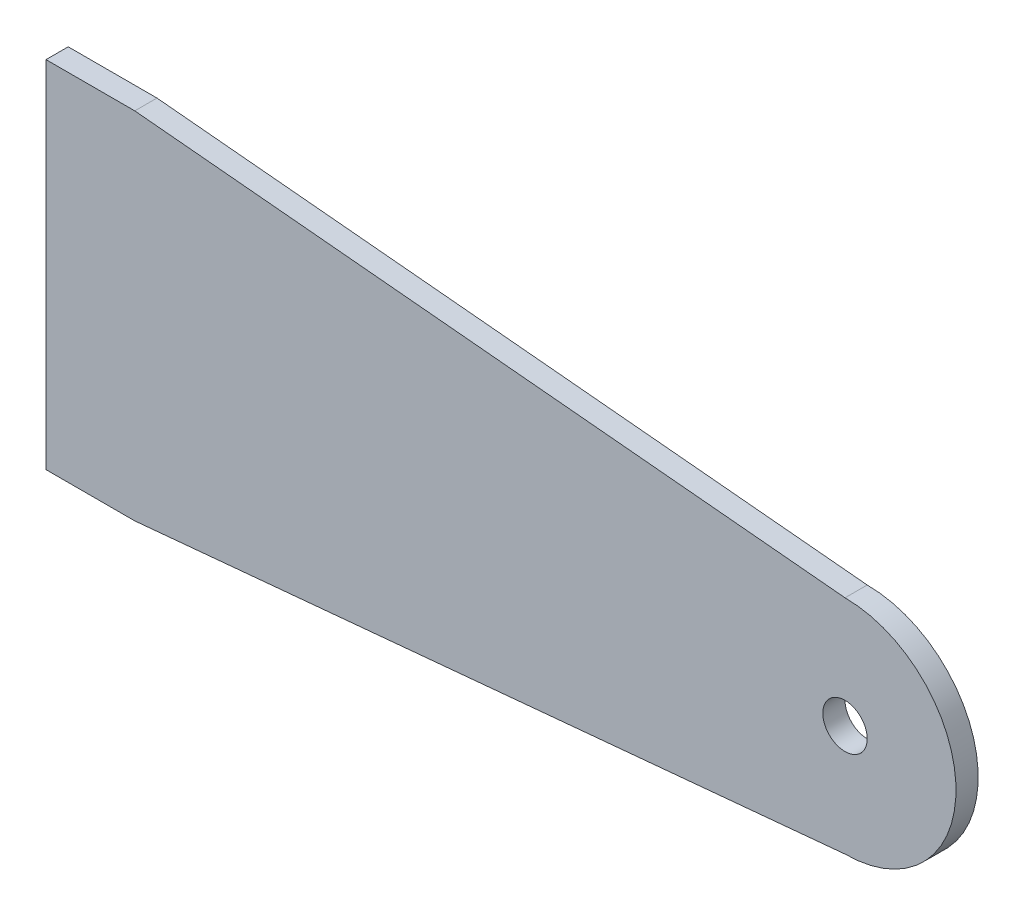
ISO-10303-21;
HEADER;
FILE_DESCRIPTION(('STEP AP214'),'2;1');
FILE_NAME('part.step','',(''),(''),'','','');
FILE_SCHEMA(('AUTOMOTIVE_DESIGN { 1 0 10303 214 1 1 1 1 }'));
ENDSEC;
DATA;
#1=APPLICATION_CONTEXT('core data for automotive mechanical design processes');
#2=APPLICATION_PROTOCOL_DEFINITION('international standard','automotive_design',2000,#1);
#3=PRODUCT_CONTEXT('',#1,'mechanical');
#4=PRODUCT('Part','Part','',(#3));
#5=PRODUCT_RELATED_PRODUCT_CATEGORY('part','',(#4));
#6=PRODUCT_DEFINITION_FORMATION('','',#4);
#7=PRODUCT_DEFINITION_CONTEXT('part definition',#1,'design');
#8=PRODUCT_DEFINITION('design','',#6,#7);
#9=PRODUCT_DEFINITION_SHAPE('','',#8);
#10=(LENGTH_UNIT() NAMED_UNIT(*) SI_UNIT(.MILLI.,.METRE.));
#11=(NAMED_UNIT(*) PLANE_ANGLE_UNIT() SI_UNIT($,.RADIAN.));
#12=(NAMED_UNIT(*) SI_UNIT($,.STERADIAN.) SOLID_ANGLE_UNIT());
#13=UNCERTAINTY_MEASURE_WITH_UNIT(LENGTH_MEASURE(1.E-05),#10,'distance_accuracy_value','');
#14=(GEOMETRIC_REPRESENTATION_CONTEXT(3) GLOBAL_UNCERTAINTY_ASSIGNED_CONTEXT((#13)) GLOBAL_UNIT_ASSIGNED_CONTEXT((#10,
#11,#12)) REPRESENTATION_CONTEXT('',''));
#15=CARTESIAN_POINT('',(0.,0.,0.));
#16=DIRECTION('',(0.,0.,1.));
#17=DIRECTION('',(1.,0.,0.));
#18=AXIS2_PLACEMENT_3D('',#15,#16,#17);
#19=CARTESIAN_POINT('',(101.6,0.,53.975));
#20=DIRECTION('',(0.,0.,1.));
#21=DIRECTION('',(1.,0.,0.));
#22=AXIS2_PLACEMENT_3D('',#19,#20,#21);
#23=PLANE('',#22);
#24=DIRECTION('',(0.,-1.,0.));
#25=VECTOR('',#24,1.);
#26=CARTESIAN_POINT('',(-12.7,25.4,53.975));
#27=LINE('',#26,#25);
#28=CARTESIAN_POINT('',(-12.7,25.4,53.975));
#29=VERTEX_POINT('',#28);
#30=CARTESIAN_POINT('',(-12.7,-25.4,53.975));
#31=VERTEX_POINT('',#30);
#32=EDGE_CURVE('E148',#29,#31,#27,.T.);
#33=ORIENTED_EDGE('',*,*,#32,.T.);
#34=DIRECTION('',(1.,0.,0.));
#35=VECTOR('',#34,1.);
#36=CARTESIAN_POINT('',(-12.7,-25.4,53.975));
#37=LINE('',#36,#35);
#38=CARTESIAN_POINT('',(0.,-25.4,53.975));
#39=VERTEX_POINT('',#38);
#40=EDGE_CURVE('E96',#31,#39,#37,.T.);
#41=ORIENTED_EDGE('',*,*,#40,.T.);
#42=DIRECTION('',(0.995634226059288,0.0933407086930583,0.));
#43=VECTOR('',#42,1.);
#44=CARTESIAN_POINT('',(101.6,-15.875,53.975));
#45=LINE('',#44,#43);
#46=CARTESIAN_POINT('',(101.6,-15.875,53.975));
#47=VERTEX_POINT('',#46);
#48=EDGE_CURVE('E109',#39,#47,#45,.T.);
#49=ORIENTED_EDGE('',*,*,#48,.T.);
#50=CARTESIAN_POINT('',(101.6,0.,53.975));
#51=DIRECTION('',(0.,0.,1.));
#52=DIRECTION('',(1.,0.,0.));
#53=AXIS2_PLACEMENT_3D('',#50,#51,#52);
#54=CIRCLE('',#53,15.875);
#55=CARTESIAN_POINT('',(101.6,15.875,53.975));
#56=VERTEX_POINT('',#55);
#57=EDGE_CURVE('E103',#47,#56,#54,.T.);
#58=ORIENTED_EDGE('',*,*,#57,.T.);
#59=DIRECTION('',(-0.995634226059288,0.0933407086930583,0.));
#60=VECTOR('',#59,1.);
#61=CARTESIAN_POINT('',(101.6,15.875,53.975));
#62=LINE('',#61,#60);
#63=CARTESIAN_POINT('',(0.,25.4,53.975));
#64=VERTEX_POINT('',#63);
#65=EDGE_CURVE('E107',#56,#64,#62,.T.);
#66=ORIENTED_EDGE('',*,*,#65,.T.);
#67=DIRECTION('',(-1.,0.,0.));
#68=VECTOR('',#67,1.);
#69=CARTESIAN_POINT('',(0.,25.4,53.975));
#70=LINE('',#69,#68);
#71=EDGE_CURVE('E59',#64,#29,#70,.T.);
#72=ORIENTED_EDGE('',*,*,#71,.T.);
#73=EDGE_LOOP('',(#33,#41,#49,#58,#66,#72));
#74=FACE_BOUND('',#73,.T.);
#75=CARTESIAN_POINT('',(101.6,0.,53.975));
#76=DIRECTION('',(0.,0.,1.));
#77=DIRECTION('',(1.,0.,0.));
#78=AXIS2_PLACEMENT_3D('',#75,#76,#77);
#79=CIRCLE('',#78,3.175);
#80=CARTESIAN_POINT('',(104.775,0.,53.975));
#81=VERTEX_POINT('',#80);
#82=EDGE_CURVE('E136',#81,#81,#79,.T.);
#83=ORIENTED_EDGE('',*,*,#82,.F.);
#84=EDGE_LOOP('',(#83));
#85=FACE_BOUND('',#84,.T.);
#86=ADVANCED_FACE('F41',(#74,#85),#23,.T.);
#87=CARTESIAN_POINT('',(101.6,0.,50.8));
#88=DIRECTION('',(0.,0.,1.));
#89=DIRECTION('',(1.,0.,0.));
#90=AXIS2_PLACEMENT_3D('',#87,#88,#89);
#91=PLANE('',#90);
#92=DIRECTION('',(0.,-1.,0.));
#93=VECTOR('',#92,1.);
#94=CARTESIAN_POINT('',(-12.7,25.4,50.8));
#95=LINE('',#94,#93);
#96=CARTESIAN_POINT('',(-12.7,25.4,50.8));
#97=VERTEX_POINT('',#96);
#98=CARTESIAN_POINT('',(-12.7,-25.4,50.8));
#99=VERTEX_POINT('',#98);
#100=EDGE_CURVE('E131',#97,#99,#95,.T.);
#101=ORIENTED_EDGE('',*,*,#100,.F.);
#102=DIRECTION('',(-1.,0.,0.));
#103=VECTOR('',#102,1.);
#104=CARTESIAN_POINT('',(0.,25.4,50.8));
#105=LINE('',#104,#103);
#106=CARTESIAN_POINT('',(0.,25.4,50.8));
#107=VERTEX_POINT('',#106);
#108=EDGE_CURVE('E88',#107,#97,#105,.T.);
#109=ORIENTED_EDGE('',*,*,#108,.F.);
#110=DIRECTION('',(-0.995634226059288,0.0933407086930583,0.));
#111=VECTOR('',#110,1.);
#112=CARTESIAN_POINT('',(101.6,15.875,50.8));
#113=LINE('',#112,#111);
#114=CARTESIAN_POINT('',(101.6,15.875,50.8));
#115=VERTEX_POINT('',#114);
#116=EDGE_CURVE('E82',#115,#107,#113,.T.);
#117=ORIENTED_EDGE('',*,*,#116,.F.);
#118=CARTESIAN_POINT('',(101.6,0.,50.8));
#119=DIRECTION('',(0.,0.,1.));
#120=DIRECTION('',(1.,0.,0.));
#121=AXIS2_PLACEMENT_3D('',#118,#119,#120);
#122=CIRCLE('',#121,15.875);
#123=CARTESIAN_POINT('',(101.6,-15.875,50.8));
#124=VERTEX_POINT('',#123);
#125=EDGE_CURVE('E118',#124,#115,#122,.T.);
#126=ORIENTED_EDGE('',*,*,#125,.F.);
#127=DIRECTION('',(0.995634226059288,0.0933407086930583,0.));
#128=VECTOR('',#127,1.);
#129=CARTESIAN_POINT('',(101.6,-15.875,50.8));
#130=LINE('',#129,#128);
#131=CARTESIAN_POINT('',(0.,-25.4,50.8));
#132=VERTEX_POINT('',#131);
#133=EDGE_CURVE('E139',#132,#124,#130,.T.);
#134=ORIENTED_EDGE('',*,*,#133,.F.);
#135=DIRECTION('',(1.,0.,0.));
#136=VECTOR('',#135,1.);
#137=CARTESIAN_POINT('',(-12.7,-25.4,50.8));
#138=LINE('',#137,#136);
#139=EDGE_CURVE('E135',#99,#132,#138,.T.);
#140=ORIENTED_EDGE('',*,*,#139,.F.);
#141=EDGE_LOOP('',(#101,#109,#117,#126,#134,#140));
#142=FACE_BOUND('',#141,.T.);
#143=CARTESIAN_POINT('',(101.6,0.,50.8));
#144=DIRECTION('',(0.,0.,1.));
#145=DIRECTION('',(1.,0.,0.));
#146=AXIS2_PLACEMENT_3D('',#143,#144,#145);
#147=CIRCLE('',#146,3.175);
#148=CARTESIAN_POINT('',(104.775,0.,50.8));
#149=VERTEX_POINT('',#148);
#150=EDGE_CURVE('E245',#149,#149,#147,.T.);
#151=ORIENTED_EDGE('',*,*,#150,.T.);
#152=EDGE_LOOP('',(#151));
#153=FACE_BOUND('',#152,.T.);
#154=ADVANCED_FACE('F161',(#142,#153),#91,.F.);
#155=CARTESIAN_POINT('',(-12.7,25.4,53.975));
#156=DIRECTION('',(1.,0.,0.));
#157=DIRECTION('',(0.,0.,-1.));
#158=AXIS2_PLACEMENT_3D('',#155,#156,#157);
#159=PLANE('',#158);
#160=ORIENTED_EDGE('',*,*,#100,.T.);
#161=DIRECTION('',(0.,0.,-1.));
#162=VECTOR('',#161,1.);
#163=CARTESIAN_POINT('',(-12.7,-25.4,53.975));
#164=LINE('',#163,#162);
#165=EDGE_CURVE('E11',#31,#99,#164,.T.);
#166=ORIENTED_EDGE('',*,*,#165,.F.);
#167=ORIENTED_EDGE('',*,*,#32,.F.);
#168=DIRECTION('',(0.,0.,-1.));
#169=VECTOR('',#168,1.);
#170=CARTESIAN_POINT('',(-12.7,25.4,53.975));
#171=LINE('',#170,#169);
#172=EDGE_CURVE('E127',#29,#97,#171,.T.);
#173=ORIENTED_EDGE('',*,*,#172,.T.);
#174=EDGE_LOOP('',(#160,#166,#167,#173));
#175=FACE_BOUND('',#174,.T.);
#176=ADVANCED_FACE('F43',(#175),#159,.F.);
#177=CARTESIAN_POINT('',(-12.7,-25.4,53.975));
#178=DIRECTION('',(0.,1.,0.));
#179=DIRECTION('',(0.,0.,1.));
#180=AXIS2_PLACEMENT_3D('',#177,#178,#179);
#181=PLANE('',#180);
#182=ORIENTED_EDGE('',*,*,#139,.T.);
#183=DIRECTION('',(0.,0.,-1.));
#184=VECTOR('',#183,1.);
#185=CARTESIAN_POINT('',(0.,-25.4,53.975));
#186=LINE('',#185,#184);
#187=EDGE_CURVE('E51',#39,#132,#186,.T.);
#188=ORIENTED_EDGE('',*,*,#187,.F.);
#189=ORIENTED_EDGE('',*,*,#40,.F.);
#190=ORIENTED_EDGE('',*,*,#165,.T.);
#191=EDGE_LOOP('',(#182,#188,#189,#190));
#192=FACE_BOUND('',#191,.T.);
#193=ADVANCED_FACE('F186',(#192),#181,.F.);
#194=CARTESIAN_POINT('',(101.6,-15.875,53.975));
#195=DIRECTION('',(-0.0933407086930584,0.995634226059288,0.));
#196=DIRECTION('',(-0.995634226059288,-0.0933407086930584,0.));
#197=AXIS2_PLACEMENT_3D('',#194,#195,#196);
#198=PLANE('',#197);
#199=ORIENTED_EDGE('',*,*,#133,.T.);
#200=DIRECTION('',(0.,0.,-1.));
#201=VECTOR('',#200,1.);
#202=CARTESIAN_POINT('',(101.6,-15.875,53.975));
#203=LINE('',#202,#201);
#204=EDGE_CURVE('E120',#47,#124,#203,.T.);
#205=ORIENTED_EDGE('',*,*,#204,.F.);
#206=ORIENTED_EDGE('',*,*,#48,.F.);
#207=ORIENTED_EDGE('',*,*,#187,.T.);
#208=EDGE_LOOP('',(#199,#205,#206,#207));
#209=FACE_BOUND('',#208,.T.);
#210=ADVANCED_FACE('F158',(#209),#198,.F.);
#211=CARTESIAN_POINT('',(101.6,0.,53.975));
#212=DIRECTION('',(0.,0.,-1.));
#213=DIRECTION('',(-1.,0.,0.));
#214=AXIS2_PLACEMENT_3D('',#211,#212,#213);
#215=CYLINDRICAL_SURFACE('',#214,15.875);
#216=ORIENTED_EDGE('',*,*,#125,.T.);
#217=DIRECTION('',(0.,0.,-1.));
#218=VECTOR('',#217,1.);
#219=CARTESIAN_POINT('',(101.6,15.875,53.975));
#220=LINE('',#219,#218);
#221=EDGE_CURVE('E115',#56,#115,#220,.T.);
#222=ORIENTED_EDGE('',*,*,#221,.F.);
#223=ORIENTED_EDGE('',*,*,#57,.F.);
#224=ORIENTED_EDGE('',*,*,#204,.T.);
#225=EDGE_LOOP('',(#216,#222,#223,#224));
#226=FACE_BOUND('',#225,.T.);
#227=ADVANCED_FACE('F116',(#226),#215,.T.);
#228=CARTESIAN_POINT('',(101.6,15.875,53.975));
#229=DIRECTION('',(-0.0933407086930583,-0.995634226059288,0.));
#230=DIRECTION('',(0.995634226059288,-0.0933407086930583,0.));
#231=AXIS2_PLACEMENT_3D('',#228,#229,#230);
#232=PLANE('',#231);
#233=ORIENTED_EDGE('',*,*,#116,.T.);
#234=DIRECTION('',(0.,0.,-1.));
#235=VECTOR('',#234,1.);
#236=CARTESIAN_POINT('',(0.,25.4,53.975));
#237=LINE('',#236,#235);
#238=EDGE_CURVE('E121',#64,#107,#237,.T.);
#239=ORIENTED_EDGE('',*,*,#238,.F.);
#240=ORIENTED_EDGE('',*,*,#65,.F.);
#241=ORIENTED_EDGE('',*,*,#221,.T.);
#242=EDGE_LOOP('',(#233,#239,#240,#241));
#243=FACE_BOUND('',#242,.T.);
#244=ADVANCED_FACE('F123',(#243),#232,.F.);
#245=CARTESIAN_POINT('',(0.,25.4,53.975));
#246=DIRECTION('',(0.,-1.,0.));
#247=DIRECTION('',(0.,0.,-1.));
#248=AXIS2_PLACEMENT_3D('',#245,#246,#247);
#249=PLANE('',#248);
#250=ORIENTED_EDGE('',*,*,#108,.T.);
#251=ORIENTED_EDGE('',*,*,#172,.F.);
#252=ORIENTED_EDGE('',*,*,#71,.F.);
#253=ORIENTED_EDGE('',*,*,#238,.T.);
#254=EDGE_LOOP('',(#250,#251,#252,#253));
#255=FACE_BOUND('',#254,.T.);
#256=ADVANCED_FACE('F166',(#255),#249,.F.);
#257=CARTESIAN_POINT('',(101.6,0.,53.975));
#258=DIRECTION('',(0.,0.,-1.));
#259=DIRECTION('',(-1.,0.,0.));
#260=AXIS2_PLACEMENT_3D('',#257,#258,#259);
#261=CYLINDRICAL_SURFACE('',#260,3.175);
#262=ORIENTED_EDGE('',*,*,#82,.T.);
#263=EDGE_LOOP('',(#262));
#264=FACE_BOUND('',#263,.T.);
#265=ORIENTED_EDGE('',*,*,#150,.F.);
#266=EDGE_LOOP('',(#265));
#267=FACE_BOUND('',#266,.T.);
#268=ADVANCED_FACE('F168',(#264,#267),#261,.F.);
#269=CLOSED_SHELL('',(#86,#154,#176,#193,#210,#227,#244,#256,#268));
#270=MANIFOLD_SOLID_BREP('B2',#269);
#271=ADVANCED_BREP_SHAPE_REPRESENTATION('',(#18,#270),#14);
#272=SHAPE_DEFINITION_REPRESENTATION(#9,#271);
ENDSEC;
END-ISO-10303-21;
